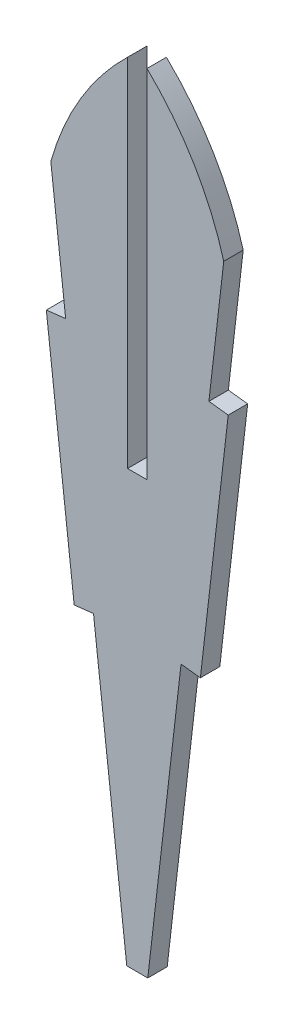
ISO-10303-21;
HEADER;
FILE_DESCRIPTION(('STEP AP214'),'2;1');
FILE_NAME('part.step','',(''),(''),'','','');
FILE_SCHEMA(('AUTOMOTIVE_DESIGN { 1 0 10303 214 1 1 1 1 }'));
ENDSEC;
DATA;
#1=APPLICATION_CONTEXT('core data for automotive mechanical design processes');
#2=APPLICATION_PROTOCOL_DEFINITION('international standard','automotive_design',2000,#1);
#3=PRODUCT_CONTEXT('',#1,'mechanical');
#4=PRODUCT('Part','Part','',(#3));
#5=PRODUCT_RELATED_PRODUCT_CATEGORY('part','',(#4));
#6=PRODUCT_DEFINITION_FORMATION('','',#4);
#7=PRODUCT_DEFINITION_CONTEXT('part definition',#1,'design');
#8=PRODUCT_DEFINITION('design','',#6,#7);
#9=PRODUCT_DEFINITION_SHAPE('','',#8);
#10=(LENGTH_UNIT() NAMED_UNIT(*) SI_UNIT(.MILLI.,.METRE.));
#11=(NAMED_UNIT(*) PLANE_ANGLE_UNIT() SI_UNIT($,.RADIAN.));
#12=(NAMED_UNIT(*) SI_UNIT($,.STERADIAN.) SOLID_ANGLE_UNIT());
#13=UNCERTAINTY_MEASURE_WITH_UNIT(LENGTH_MEASURE(1.E-05),#10,'distance_accuracy_value','');
#14=(GEOMETRIC_REPRESENTATION_CONTEXT(3) GLOBAL_UNCERTAINTY_ASSIGNED_CONTEXT((#13)) GLOBAL_UNIT_ASSIGNED_CONTEXT((#10,
#11,#12)) REPRESENTATION_CONTEXT('',''));
#15=CARTESIAN_POINT('',(0.,0.,0.));
#16=DIRECTION('',(0.,0.,1.));
#17=DIRECTION('',(1.,0.,0.));
#18=AXIS2_PLACEMENT_3D('',#15,#16,#17);
#19=CARTESIAN_POINT('',(-1.58511702127161,-218.846004156376,1.524));
#20=DIRECTION('',(0.,1.,0.));
#21=DIRECTION('',(0.,0.,1.));
#22=AXIS2_PLACEMENT_3D('',#19,#20,#21);
#23=PLANE('',#22);
#24=DIRECTION('',(1.,0.,0.));
#25=VECTOR('',#24,1.);
#26=CARTESIAN_POINT('',(-1.58511702127161,-218.846004156376,0.));
#27=LINE('',#26,#25);
#28=CARTESIAN_POINT('',(-1.58511702127161,-218.846004156376,0.));
#29=VERTEX_POINT('',#28);
#30=CARTESIAN_POINT('',(0.0611170212716098,-218.846004156376,0.));
#31=VERTEX_POINT('',#30);
#32=EDGE_CURVE('E185',#29,#31,#27,.T.);
#33=ORIENTED_EDGE('',*,*,#32,.T.);
#34=DIRECTION('',(0.,0.,-1.));
#35=VECTOR('',#34,1.);
#36=CARTESIAN_POINT('',(0.0611170212716098,-218.846004156376,1.524));
#37=LINE('',#36,#35);
#38=CARTESIAN_POINT('',(0.0611170212716098,-218.846004156376,1.524));
#39=VERTEX_POINT('',#38);
#40=EDGE_CURVE('E11',#39,#31,#37,.T.);
#41=ORIENTED_EDGE('',*,*,#40,.F.);
#42=DIRECTION('',(1.,0.,0.));
#43=VECTOR('',#42,1.);
#44=CARTESIAN_POINT('',(-1.58511702127161,-218.846004156376,1.524));
#45=LINE('',#44,#43);
#46=CARTESIAN_POINT('',(-1.58511702127161,-218.846004156376,1.524));
#47=VERTEX_POINT('',#46);
#48=EDGE_CURVE('E215',#47,#39,#45,.T.);
#49=ORIENTED_EDGE('',*,*,#48,.F.);
#50=DIRECTION('',(0.,0.,-1.));
#51=VECTOR('',#50,1.);
#52=CARTESIAN_POINT('',(-1.58511702127161,-218.846004156376,1.524));
#53=LINE('',#52,#51);
#54=EDGE_CURVE('E181',#47,#29,#53,.T.);
#55=ORIENTED_EDGE('',*,*,#54,.T.);
#56=EDGE_LOOP('',(#33,#41,#49,#55));
#57=FACE_BOUND('',#56,.T.);
#58=ADVANCED_FACE('F41',(#57),#23,.F.);
#59=CARTESIAN_POINT('',(2.66814649701083,-196.241399758573,1.524));
#60=DIRECTION('',(-0.993414910122723,0.114572319282901,0.));
#61=DIRECTION('',(-0.114572319282901,-0.993414910122723,0.));
#62=AXIS2_PLACEMENT_3D('',#59,#60,#61);
#63=PLANE('',#62);
#64=DIRECTION('',(0.114572319282901,0.993414910122723,0.));
#65=VECTOR('',#64,1.);
#66=CARTESIAN_POINT('',(2.66814649701083,-196.241399758573,0.));
#67=LINE('',#66,#65);
#68=CARTESIAN_POINT('',(2.66814649701083,-196.241399758573,0.));
#69=VERTEX_POINT('',#68);
#70=EDGE_CURVE('E188',#31,#69,#67,.T.);
#71=ORIENTED_EDGE('',*,*,#70,.T.);
#72=DIRECTION('',(0.,0.,-1.));
#73=VECTOR('',#72,1.);
#74=CARTESIAN_POINT('',(2.66814649701083,-196.241399758573,1.524));
#75=LINE('',#74,#73);
#76=CARTESIAN_POINT('',(2.66814649701083,-196.241399758573,1.524));
#77=VERTEX_POINT('',#76);
#78=EDGE_CURVE('E49',#77,#69,#75,.T.);
#79=ORIENTED_EDGE('',*,*,#78,.F.);
#80=DIRECTION('',(0.114572319282901,0.993414910122723,0.));
#81=VECTOR('',#80,1.);
#82=CARTESIAN_POINT('',(2.66814649701083,-196.241399758573,1.524));
#83=LINE('',#82,#81);
#84=EDGE_CURVE('E124',#39,#77,#83,.T.);
#85=ORIENTED_EDGE('',*,*,#84,.F.);
#86=ORIENTED_EDGE('',*,*,#40,.T.);
#87=EDGE_LOOP('',(#71,#79,#85,#86));
#88=FACE_BOUND('',#87,.T.);
#89=ADVANCED_FACE('F313',(#88),#63,.F.);
#90=CARTESIAN_POINT('',(2.66814649701083,-196.241399758573,1.524));
#91=DIRECTION('',(0.114572319282904,0.993414910122722,0.));
#92=DIRECTION('',(-0.993414910122722,0.114572319282904,0.));
#93=AXIS2_PLACEMENT_3D('',#90,#91,#92);
#94=PLANE('',#93);
#95=DIRECTION('',(0.993414910122722,-0.114572319282904,0.));
#96=VECTOR('',#95,1.);
#97=CARTESIAN_POINT('',(2.66814649701083,-196.241399758573,0.));
#98=LINE('',#97,#96);
#99=CARTESIAN_POINT('',(4.18211082003786,-196.41600797316,0.));
#100=VERTEX_POINT('',#99);
#101=EDGE_CURVE('E190',#69,#100,#98,.T.);
#102=ORIENTED_EDGE('',*,*,#101,.T.);
#103=DIRECTION('',(0.,0.,-1.));
#104=VECTOR('',#103,1.);
#105=CARTESIAN_POINT('',(4.18211082003786,-196.41600797316,1.524));
#106=LINE('',#105,#104);
#107=CARTESIAN_POINT('',(4.18211082003786,-196.41600797316,1.524));
#108=VERTEX_POINT('',#107);
#109=EDGE_CURVE('E246',#108,#100,#106,.T.);
#110=ORIENTED_EDGE('',*,*,#109,.F.);
#111=DIRECTION('',(0.993414910122722,-0.114572319282904,0.));
#112=VECTOR('',#111,1.);
#113=CARTESIAN_POINT('',(2.66814649701083,-196.241399758573,1.524));
#114=LINE('',#113,#112);
#115=EDGE_CURVE('E254',#77,#108,#114,.T.);
#116=ORIENTED_EDGE('',*,*,#115,.F.);
#117=ORIENTED_EDGE('',*,*,#78,.T.);
#118=EDGE_LOOP('',(#102,#110,#116,#117));
#119=FACE_BOUND('',#118,.T.);
#120=ADVANCED_FACE('F252',(#119),#94,.F.);
#121=CARTESIAN_POINT('',(6.36471350237713,-177.491453935322,1.524));
#122=DIRECTION('',(-0.993414910122722,0.114572319282902,0.));
#123=DIRECTION('',(-0.114572319282902,-0.993414910122723,0.));
#124=AXIS2_PLACEMENT_3D('',#121,#122,#123);
#125=PLANE('',#124);
#126=DIRECTION('',(0.114572319282902,0.993414910122722,0.));
#127=VECTOR('',#126,1.);
#128=CARTESIAN_POINT('',(6.36471350237713,-177.491453935322,0.));
#129=LINE('',#128,#127);
#130=CARTESIAN_POINT('',(6.36471350237713,-177.491453935322,0.));
#131=VERTEX_POINT('',#130);
#132=EDGE_CURVE('E192',#100,#131,#129,.T.);
#133=ORIENTED_EDGE('',*,*,#132,.T.);
#134=DIRECTION('',(0.,0.,-1.));
#135=VECTOR('',#134,1.);
#136=CARTESIAN_POINT('',(6.36471350237713,-177.491453935322,1.524));
#137=LINE('',#136,#135);
#138=CARTESIAN_POINT('',(6.36471350237713,-177.491453935322,1.524));
#139=VERTEX_POINT('',#138);
#140=EDGE_CURVE('E243',#139,#131,#137,.T.);
#141=ORIENTED_EDGE('',*,*,#140,.F.);
#142=DIRECTION('',(0.114572319282902,0.993414910122722,0.));
#143=VECTOR('',#142,1.);
#144=CARTESIAN_POINT('',(6.36471350237713,-177.491453935322,1.524));
#145=LINE('',#144,#143);
#146=EDGE_CURVE('E272',#108,#139,#145,.T.);
#147=ORIENTED_EDGE('',*,*,#146,.F.);
#148=ORIENTED_EDGE('',*,*,#109,.T.);
#149=EDGE_LOOP('',(#133,#141,#147,#148));
#150=FACE_BOUND('',#149,.T.);
#151=ADVANCED_FACE('F263',(#150),#125,.F.);
#152=CARTESIAN_POINT('',(4.8507491793501,-177.316845720735,1.524));
#153=DIRECTION('',(-0.114572319282922,-0.99341491012272,0.));
#154=DIRECTION('',(0.99341491012272,-0.114572319282922,0.));
#155=AXIS2_PLACEMENT_3D('',#152,#153,#154);
#156=PLANE('',#155);
#157=DIRECTION('',(-0.99341491012272,0.114572319282922,0.));
#158=VECTOR('',#157,1.);
#159=CARTESIAN_POINT('',(4.8507491793501,-177.316845720735,0.));
#160=LINE('',#159,#158);
#161=CARTESIAN_POINT('',(4.8507491793501,-177.316845720735,0.));
#162=VERTEX_POINT('',#161);
#163=EDGE_CURVE('E194',#131,#162,#160,.T.);
#164=ORIENTED_EDGE('',*,*,#163,.T.);
#165=DIRECTION('',(0.,0.,-1.));
#166=VECTOR('',#165,1.);
#167=CARTESIAN_POINT('',(4.8507491793501,-177.316845720735,1.524));
#168=LINE('',#167,#166);
#169=CARTESIAN_POINT('',(4.8507491793501,-177.316845720735,1.524));
#170=VERTEX_POINT('',#169);
#171=EDGE_CURVE('E240',#170,#162,#168,.T.);
#172=ORIENTED_EDGE('',*,*,#171,.F.);
#173=DIRECTION('',(-0.99341491012272,0.114572319282922,0.));
#174=VECTOR('',#173,1.);
#175=CARTESIAN_POINT('',(4.8507491793501,-177.316845720735,1.524));
#176=LINE('',#175,#174);
#177=EDGE_CURVE('E269',#139,#170,#176,.T.);
#178=ORIENTED_EDGE('',*,*,#177,.F.);
#179=ORIENTED_EDGE('',*,*,#140,.T.);
#180=EDGE_LOOP('',(#164,#172,#178,#179));
#181=FACE_BOUND('',#180,.T.);
#182=ADVANCED_FACE('F267',(#181),#156,.F.);
#183=CARTESIAN_POINT('',(6.01355397832156,-167.23458822529,1.524));
#184=DIRECTION('',(-0.993414910122723,0.114572319282901,0.));
#185=DIRECTION('',(-0.114572319282901,-0.993414910122723,0.));
#186=AXIS2_PLACEMENT_3D('',#183,#184,#185);
#187=PLANE('',#186);
#188=DIRECTION('',(0.114572319282901,0.993414910122723,0.));
#189=VECTOR('',#188,1.);
#190=CARTESIAN_POINT('',(6.01355397832156,-167.23458822529,0.));
#191=LINE('',#190,#189);
#192=CARTESIAN_POINT('',(6.01355397832155,-167.23458822529,0.));
#193=VERTEX_POINT('',#192);
#194=EDGE_CURVE('E196',#162,#193,#191,.T.);
#195=ORIENTED_EDGE('',*,*,#194,.T.);
#196=DIRECTION('',(0.,0.,-1.));
#197=VECTOR('',#196,1.);
#198=CARTESIAN_POINT('',(6.01355397832155,-167.23458822529,1.524));
#199=LINE('',#198,#197);
#200=CARTESIAN_POINT('',(6.01355397832155,-167.23458822529,1.524));
#201=VERTEX_POINT('',#200);
#202=EDGE_CURVE('E237',#201,#193,#199,.T.);
#203=ORIENTED_EDGE('',*,*,#202,.F.);
#204=DIRECTION('',(0.114572319282901,0.993414910122723,0.));
#205=VECTOR('',#204,1.);
#206=CARTESIAN_POINT('',(6.01355397832156,-167.23458822529,1.524));
#207=LINE('',#206,#205);
#208=EDGE_CURVE('E271',#170,#201,#207,.T.);
#209=ORIENTED_EDGE('',*,*,#208,.F.);
#210=ORIENTED_EDGE('',*,*,#171,.T.);
#211=EDGE_LOOP('',(#195,#203,#209,#210));
#212=FACE_BOUND('',#211,.T.);
#213=ADVANCED_FACE('F326',(#212),#187,.F.);
#214=CARTESIAN_POINT('',(-15.559815132406,-173.267487686723,1.524));
#215=DIRECTION('',(0.,0.,-1.));
#216=DIRECTION('',(-1.,0.,0.));
#217=AXIS2_PLACEMENT_3D('',#214,#215,#216);
#218=CYLINDRICAL_SURFACE('',#217,22.4010296794468);
#219=CARTESIAN_POINT('',(-15.559815132406,-173.267487686723,0.));
#220=DIRECTION('',(0.,0.,1.));
#221=DIRECTION('',(1.,0.,0.));
#222=AXIS2_PLACEMENT_3D('',#219,#220,#221);
#223=CIRCLE('',#222,22.4010296794468);
#224=CARTESIAN_POINT('',(0.,-157.152330729846,0.));
#225=VERTEX_POINT('',#224);
#226=EDGE_CURVE('E198',#193,#225,#223,.T.);
#227=ORIENTED_EDGE('',*,*,#226,.T.);
#228=DIRECTION('',(0.,0.,-1.));
#229=VECTOR('',#228,1.);
#230=CARTESIAN_POINT('',(0.,-157.152330729846,1.524));
#231=LINE('',#230,#229);
#232=CARTESIAN_POINT('',(0.,-157.152330729846,1.524));
#233=VERTEX_POINT('',#232);
#234=EDGE_CURVE('E234',#233,#225,#231,.T.);
#235=ORIENTED_EDGE('',*,*,#234,.F.);
#236=CARTESIAN_POINT('',(-15.559815132406,-173.267487686723,1.524));
#237=DIRECTION('',(0.,0.,1.));
#238=DIRECTION('',(1.,0.,0.));
#239=AXIS2_PLACEMENT_3D('',#236,#237,#238);
#240=CIRCLE('',#239,22.4010296794468);
#241=EDGE_CURVE('E274',#201,#233,#240,.T.);
#242=ORIENTED_EDGE('',*,*,#241,.F.);
#243=ORIENTED_EDGE('',*,*,#202,.T.);
#244=EDGE_LOOP('',(#227,#235,#242,#243));
#245=FACE_BOUND('',#244,.T.);
#246=ADVANCED_FACE('F329',(#245),#218,.T.);
#247=CARTESIAN_POINT('',(0.,-185.062075143658,1.524));
#248=DIRECTION('',(1.,0.,0.));
#249=DIRECTION('',(0.,1.,0.));
#250=AXIS2_PLACEMENT_3D('',#247,#248,#249);
#251=PLANE('',#250);
#252=DIRECTION('',(0.,-1.,0.));
#253=VECTOR('',#252,1.);
#254=CARTESIAN_POINT('',(0.,-185.062075143658,0.));
#255=LINE('',#254,#253);
#256=CARTESIAN_POINT('',(0.,-185.062075143658,0.));
#257=VERTEX_POINT('',#256);
#258=EDGE_CURVE('E200',#225,#257,#255,.T.);
#259=ORIENTED_EDGE('',*,*,#258,.T.);
#260=DIRECTION('',(0.,0.,-1.));
#261=VECTOR('',#260,1.);
#262=CARTESIAN_POINT('',(0.,-185.062075143658,1.524));
#263=LINE('',#262,#261);
#264=CARTESIAN_POINT('',(0.,-185.062075143658,1.524));
#265=VERTEX_POINT('',#264);
#266=EDGE_CURVE('E231',#265,#257,#263,.T.);
#267=ORIENTED_EDGE('',*,*,#266,.F.);
#268=DIRECTION('',(0.,-1.,0.));
#269=VECTOR('',#268,1.);
#270=CARTESIAN_POINT('',(0.,-185.062075143658,1.524));
#271=LINE('',#270,#269);
#272=EDGE_CURVE('E280',#233,#265,#271,.T.);
#273=ORIENTED_EDGE('',*,*,#272,.F.);
#274=ORIENTED_EDGE('',*,*,#234,.T.);
#275=EDGE_LOOP('',(#259,#267,#273,#274));
#276=FACE_BOUND('',#275,.T.);
#277=ADVANCED_FACE('F333',(#276),#251,.F.);
#278=CARTESIAN_POINT('',(0.,-185.062075143658,1.524));
#279=DIRECTION('',(0.,-1.,0.));
#280=DIRECTION('',(0.,0.,-1.));
#281=AXIS2_PLACEMENT_3D('',#278,#279,#280);
#282=PLANE('',#281);
#283=DIRECTION('',(-1.,0.,0.));
#284=VECTOR('',#283,1.);
#285=CARTESIAN_POINT('',(0.,-185.062075143658,0.));
#286=LINE('',#285,#284);
#287=CARTESIAN_POINT('',(-1.524,-185.062075143658,0.));
#288=VERTEX_POINT('',#287);
#289=EDGE_CURVE('E202',#257,#288,#286,.T.);
#290=ORIENTED_EDGE('',*,*,#289,.T.);
#291=DIRECTION('',(0.,0.,-1.));
#292=VECTOR('',#291,1.);
#293=CARTESIAN_POINT('',(-1.524,-185.062075143658,1.524));
#294=LINE('',#293,#292);
#295=CARTESIAN_POINT('',(-1.524,-185.062075143658,1.524));
#296=VERTEX_POINT('',#295);
#297=EDGE_CURVE('E228',#296,#288,#294,.T.);
#298=ORIENTED_EDGE('',*,*,#297,.F.);
#299=DIRECTION('',(-1.,0.,0.));
#300=VECTOR('',#299,1.);
#301=CARTESIAN_POINT('',(0.,-185.062075143658,1.524));
#302=LINE('',#301,#300);
#303=EDGE_CURVE('E282',#265,#296,#302,.T.);
#304=ORIENTED_EDGE('',*,*,#303,.F.);
#305=ORIENTED_EDGE('',*,*,#266,.T.);
#306=EDGE_LOOP('',(#290,#298,#304,#305));
#307=FACE_BOUND('',#306,.T.);
#308=ADVANCED_FACE('F337',(#307),#282,.F.);
#309=CARTESIAN_POINT('',(-1.524,-185.062075143658,1.524));
#310=DIRECTION('',(-1.,0.,0.));
#311=DIRECTION('',(0.,-1.,0.));
#312=AXIS2_PLACEMENT_3D('',#309,#310,#311);
#313=PLANE('',#312);
#314=DIRECTION('',(0.,1.,0.));
#315=VECTOR('',#314,1.);
#316=CARTESIAN_POINT('',(-1.524,-185.062075143658,0.));
#317=LINE('',#316,#315);
#318=CARTESIAN_POINT('',(-1.52400000000001,-157.152330729846,0.));
#319=VERTEX_POINT('',#318);
#320=EDGE_CURVE('E204',#288,#319,#317,.T.);
#321=ORIENTED_EDGE('',*,*,#320,.T.);
#322=DIRECTION('',(0.,0.,-1.));
#323=VECTOR('',#322,1.);
#324=CARTESIAN_POINT('',(-1.52400000000001,-157.152330729846,1.524));
#325=LINE('',#324,#323);
#326=CARTESIAN_POINT('',(-1.52400000000001,-157.152330729846,1.524));
#327=VERTEX_POINT('',#326);
#328=EDGE_CURVE('E225',#327,#319,#325,.T.);
#329=ORIENTED_EDGE('',*,*,#328,.F.);
#330=DIRECTION('',(0.,1.,0.));
#331=VECTOR('',#330,1.);
#332=CARTESIAN_POINT('',(-1.524,-185.062075143658,1.524));
#333=LINE('',#332,#331);
#334=EDGE_CURVE('E284',#296,#327,#333,.T.);
#335=ORIENTED_EDGE('',*,*,#334,.F.);
#336=ORIENTED_EDGE('',*,*,#297,.T.);
#337=EDGE_LOOP('',(#321,#329,#335,#336));
#338=FACE_BOUND('',#337,.T.);
#339=ADVANCED_FACE('F341',(#338),#313,.F.);
#340=CARTESIAN_POINT('',(14.035815132406,-173.267487686723,1.524));
#341=DIRECTION('',(0.,0.,-1.));
#342=DIRECTION('',(-1.,0.,0.));
#343=AXIS2_PLACEMENT_3D('',#340,#341,#342);
#344=CYLINDRICAL_SURFACE('',#343,22.4010296794468);
#345=CARTESIAN_POINT('',(14.035815132406,-173.267487686723,0.));
#346=DIRECTION('',(0.,0.,1.));
#347=DIRECTION('',(-1.,0.,0.));
#348=AXIS2_PLACEMENT_3D('',#345,#346,#347);
#349=CIRCLE('',#348,22.4010296794468);
#350=CARTESIAN_POINT('',(-7.53755397832156,-167.23458822529,0.));
#351=VERTEX_POINT('',#350);
#352=EDGE_CURVE('E206',#319,#351,#349,.T.);
#353=ORIENTED_EDGE('',*,*,#352,.T.);
#354=DIRECTION('',(0.,0.,-1.));
#355=VECTOR('',#354,1.);
#356=CARTESIAN_POINT('',(-7.53755397832156,-167.23458822529,1.524));
#357=LINE('',#356,#355);
#358=CARTESIAN_POINT('',(-7.53755397832156,-167.23458822529,1.524));
#359=VERTEX_POINT('',#358);
#360=EDGE_CURVE('E222',#359,#351,#357,.T.);
#361=ORIENTED_EDGE('',*,*,#360,.F.);
#362=CARTESIAN_POINT('',(14.035815132406,-173.267487686723,1.524));
#363=DIRECTION('',(0.,0.,1.));
#364=DIRECTION('',(-1.,0.,0.));
#365=AXIS2_PLACEMENT_3D('',#362,#363,#364);
#366=CIRCLE('',#365,22.4010296794468);
#367=EDGE_CURVE('E286',#327,#359,#366,.T.);
#368=ORIENTED_EDGE('',*,*,#367,.F.);
#369=ORIENTED_EDGE('',*,*,#328,.T.);
#370=EDGE_LOOP('',(#353,#361,#368,#369));
#371=FACE_BOUND('',#370,.T.);
#372=ADVANCED_FACE('F345',(#371),#344,.T.);
#373=CARTESIAN_POINT('',(-7.53755397832156,-167.23458822529,1.524));
#374=DIRECTION('',(0.993414910122723,0.114572319282901,0.));
#375=DIRECTION('',(-0.114572319282901,0.993414910122723,0.));
#376=AXIS2_PLACEMENT_3D('',#373,#374,#375);
#377=PLANE('',#376);
#378=DIRECTION('',(0.114572319282901,-0.993414910122723,0.));
#379=VECTOR('',#378,1.);
#380=CARTESIAN_POINT('',(-7.53755397832156,-167.23458822529,0.));
#381=LINE('',#380,#379);
#382=CARTESIAN_POINT('',(-6.3747491793501,-177.316845720735,0.));
#383=VERTEX_POINT('',#382);
#384=EDGE_CURVE('E208',#351,#383,#381,.T.);
#385=ORIENTED_EDGE('',*,*,#384,.T.);
#386=DIRECTION('',(0.,0.,-1.));
#387=VECTOR('',#386,1.);
#388=CARTESIAN_POINT('',(-6.3747491793501,-177.316845720735,1.524));
#389=LINE('',#388,#387);
#390=CARTESIAN_POINT('',(-6.3747491793501,-177.316845720735,1.524));
#391=VERTEX_POINT('',#390);
#392=EDGE_CURVE('E219',#391,#383,#389,.T.);
#393=ORIENTED_EDGE('',*,*,#392,.F.);
#394=DIRECTION('',(0.114572319282901,-0.993414910122723,0.));
#395=VECTOR('',#394,1.);
#396=CARTESIAN_POINT('',(-7.53755397832156,-167.23458822529,1.524));
#397=LINE('',#396,#395);
#398=EDGE_CURVE('E288',#359,#391,#397,.T.);
#399=ORIENTED_EDGE('',*,*,#398,.F.);
#400=ORIENTED_EDGE('',*,*,#360,.T.);
#401=EDGE_LOOP('',(#385,#393,#399,#400));
#402=FACE_BOUND('',#401,.T.);
#403=ADVANCED_FACE('F294',(#402),#377,.F.);
#404=CARTESIAN_POINT('',(-6.3747491793501,-177.316845720735,1.524));
#405=DIRECTION('',(0.114572319282922,-0.99341491012272,0.));
#406=DIRECTION('',(0.99341491012272,0.114572319282922,0.));
#407=AXIS2_PLACEMENT_3D('',#404,#405,#406);
#408=PLANE('',#407);
#409=DIRECTION('',(-0.99341491012272,-0.114572319282922,0.));
#410=VECTOR('',#409,1.);
#411=CARTESIAN_POINT('',(-6.3747491793501,-177.316845720735,0.));
#412=LINE('',#411,#410);
#413=CARTESIAN_POINT('',(-7.88871350237714,-177.491453935322,0.));
#414=VERTEX_POINT('',#413);
#415=EDGE_CURVE('E210',#383,#414,#412,.T.);
#416=ORIENTED_EDGE('',*,*,#415,.T.);
#417=DIRECTION('',(0.,0.,-1.));
#418=VECTOR('',#417,1.);
#419=CARTESIAN_POINT('',(-7.88871350237714,-177.491453935322,1.524));
#420=LINE('',#419,#418);
#421=CARTESIAN_POINT('',(-7.88871350237714,-177.491453935322,1.524));
#422=VERTEX_POINT('',#421);
#423=EDGE_CURVE('E176',#422,#414,#420,.T.);
#424=ORIENTED_EDGE('',*,*,#423,.F.);
#425=DIRECTION('',(-0.99341491012272,-0.114572319282922,0.));
#426=VECTOR('',#425,1.);
#427=CARTESIAN_POINT('',(-6.3747491793501,-177.316845720735,1.524));
#428=LINE('',#427,#426);
#429=EDGE_CURVE('E167',#391,#422,#428,.T.);
#430=ORIENTED_EDGE('',*,*,#429,.F.);
#431=ORIENTED_EDGE('',*,*,#392,.T.);
#432=EDGE_LOOP('',(#416,#424,#430,#431));
#433=FACE_BOUND('',#432,.T.);
#434=ADVANCED_FACE('F298',(#433),#408,.F.);
#435=CARTESIAN_POINT('',(-7.88871350237714,-177.491453935322,1.524));
#436=DIRECTION('',(0.993414910122722,0.114572319282902,0.));
#437=DIRECTION('',(-0.114572319282902,0.993414910122723,0.));
#438=AXIS2_PLACEMENT_3D('',#435,#436,#437);
#439=PLANE('',#438);
#440=DIRECTION('',(0.114572319282902,-0.993414910122722,0.));
#441=VECTOR('',#440,1.);
#442=CARTESIAN_POINT('',(-7.88871350237714,-177.491453935322,0.));
#443=LINE('',#442,#441);
#444=CARTESIAN_POINT('',(-5.70611082003786,-196.41600797316,0.));
#445=VERTEX_POINT('',#444);
#446=EDGE_CURVE('E175',#414,#445,#443,.T.);
#447=ORIENTED_EDGE('',*,*,#446,.T.);
#448=DIRECTION('',(0.,0.,-1.));
#449=VECTOR('',#448,1.);
#450=CARTESIAN_POINT('',(-5.70611082003786,-196.41600797316,1.524));
#451=LINE('',#450,#449);
#452=CARTESIAN_POINT('',(-5.70611082003786,-196.41600797316,1.524));
#453=VERTEX_POINT('',#452);
#454=EDGE_CURVE('E172',#453,#445,#451,.T.);
#455=ORIENTED_EDGE('',*,*,#454,.F.);
#456=DIRECTION('',(0.114572319282902,-0.993414910122722,0.));
#457=VECTOR('',#456,1.);
#458=CARTESIAN_POINT('',(-7.88871350237714,-177.491453935322,1.524));
#459=LINE('',#458,#457);
#460=EDGE_CURVE('E161',#422,#453,#459,.T.);
#461=ORIENTED_EDGE('',*,*,#460,.F.);
#462=ORIENTED_EDGE('',*,*,#423,.T.);
#463=EDGE_LOOP('',(#447,#455,#461,#462));
#464=FACE_BOUND('',#463,.T.);
#465=ADVANCED_FACE('F173',(#464),#439,.F.);
#466=CARTESIAN_POINT('',(-4.19214649701083,-196.241399758573,1.524));
#467=DIRECTION('',(-0.114572319282904,0.993414910122722,0.));
#468=DIRECTION('',(-0.993414910122722,-0.114572319282904,0.));
#469=AXIS2_PLACEMENT_3D('',#466,#467,#468);
#470=PLANE('',#469);
#471=DIRECTION('',(0.993414910122722,0.114572319282904,0.));
#472=VECTOR('',#471,1.);
#473=CARTESIAN_POINT('',(-4.19214649701083,-196.241399758573,0.));
#474=LINE('',#473,#472);
#475=CARTESIAN_POINT('',(-4.19214649701083,-196.241399758573,0.));
#476=VERTEX_POINT('',#475);
#477=EDGE_CURVE('E110',#445,#476,#474,.T.);
#478=ORIENTED_EDGE('',*,*,#477,.T.);
#479=DIRECTION('',(0.,0.,-1.));
#480=VECTOR('',#479,1.);
#481=CARTESIAN_POINT('',(-4.19214649701083,-196.241399758573,1.524));
#482=LINE('',#481,#480);
#483=CARTESIAN_POINT('',(-4.19214649701083,-196.241399758573,1.524));
#484=VERTEX_POINT('',#483);
#485=EDGE_CURVE('E177',#484,#476,#482,.T.);
#486=ORIENTED_EDGE('',*,*,#485,.F.);
#487=DIRECTION('',(0.993414910122722,0.114572319282904,0.));
#488=VECTOR('',#487,1.);
#489=CARTESIAN_POINT('',(-4.19214649701083,-196.241399758573,1.524));
#490=LINE('',#489,#488);
#491=EDGE_CURVE('E165',#453,#484,#490,.T.);
#492=ORIENTED_EDGE('',*,*,#491,.F.);
#493=ORIENTED_EDGE('',*,*,#454,.T.);
#494=EDGE_LOOP('',(#478,#486,#492,#493));
#495=FACE_BOUND('',#494,.T.);
#496=ADVANCED_FACE('F179',(#495),#470,.F.);
#497=CARTESIAN_POINT('',(-4.19214649701083,-196.241399758573,1.524));
#498=DIRECTION('',(0.993414910122723,0.114572319282901,0.));
#499=DIRECTION('',(-0.114572319282901,0.993414910122723,0.));
#500=AXIS2_PLACEMENT_3D('',#497,#498,#499);
#501=PLANE('',#500);
#502=DIRECTION('',(0.114572319282901,-0.993414910122723,0.));
#503=VECTOR('',#502,1.);
#504=CARTESIAN_POINT('',(-4.19214649701083,-196.241399758573,0.));
#505=LINE('',#504,#503);
#506=EDGE_CURVE('E116',#476,#29,#505,.T.);
#507=ORIENTED_EDGE('',*,*,#506,.T.);
#508=ORIENTED_EDGE('',*,*,#54,.F.);
#509=DIRECTION('',(0.114572319282901,-0.993414910122723,0.));
#510=VECTOR('',#509,1.);
#511=CARTESIAN_POINT('',(-4.19214649701083,-196.241399758573,1.524));
#512=LINE('',#511,#510);
#513=EDGE_CURVE('E57',#484,#47,#512,.T.);
#514=ORIENTED_EDGE('',*,*,#513,.F.);
#515=ORIENTED_EDGE('',*,*,#485,.T.);
#516=EDGE_LOOP('',(#507,#508,#514,#515));
#517=FACE_BOUND('',#516,.T.);
#518=ADVANCED_FACE('F302',(#517),#501,.F.);
#519=CARTESIAN_POINT('',(-15.559815132406,-173.267487686723,1.524));
#520=DIRECTION('',(0.,0.,1.));
#521=DIRECTION('',(1.,0.,0.));
#522=AXIS2_PLACEMENT_3D('',#519,#520,#521);
#523=PLANE('',#522);
#524=ORIENTED_EDGE('',*,*,#48,.T.);
#525=ORIENTED_EDGE('',*,*,#84,.T.);
#526=ORIENTED_EDGE('',*,*,#115,.T.);
#527=ORIENTED_EDGE('',*,*,#146,.T.);
#528=ORIENTED_EDGE('',*,*,#177,.T.);
#529=ORIENTED_EDGE('',*,*,#208,.T.);
#530=ORIENTED_EDGE('',*,*,#241,.T.);
#531=ORIENTED_EDGE('',*,*,#272,.T.);
#532=ORIENTED_EDGE('',*,*,#303,.T.);
#533=ORIENTED_EDGE('',*,*,#334,.T.);
#534=ORIENTED_EDGE('',*,*,#367,.T.);
#535=ORIENTED_EDGE('',*,*,#398,.T.);
#536=ORIENTED_EDGE('',*,*,#429,.T.);
#537=ORIENTED_EDGE('',*,*,#460,.T.);
#538=ORIENTED_EDGE('',*,*,#491,.T.);
#539=ORIENTED_EDGE('',*,*,#513,.T.);
#540=EDGE_LOOP('',(#524,#525,#526,#527,#528,#529,#530,#531,#532,#533,#534,#535,#536,#537,#538,#539));
#541=FACE_BOUND('',#540,.T.);
#542=ADVANCED_FACE('F163',(#541),#523,.T.);
#543=CARTESIAN_POINT('',(-15.559815132406,-173.267487686723,0.));
#544=DIRECTION('',(0.,0.,1.));
#545=DIRECTION('',(1.,0.,0.));
#546=AXIS2_PLACEMENT_3D('',#543,#544,#545);
#547=PLANE('',#546);
#548=ORIENTED_EDGE('',*,*,#32,.F.);
#549=ORIENTED_EDGE('',*,*,#506,.F.);
#550=ORIENTED_EDGE('',*,*,#477,.F.);
#551=ORIENTED_EDGE('',*,*,#446,.F.);
#552=ORIENTED_EDGE('',*,*,#415,.F.);
#553=ORIENTED_EDGE('',*,*,#384,.F.);
#554=ORIENTED_EDGE('',*,*,#352,.F.);
#555=ORIENTED_EDGE('',*,*,#320,.F.);
#556=ORIENTED_EDGE('',*,*,#289,.F.);
#557=ORIENTED_EDGE('',*,*,#258,.F.);
#558=ORIENTED_EDGE('',*,*,#226,.F.);
#559=ORIENTED_EDGE('',*,*,#194,.F.);
#560=ORIENTED_EDGE('',*,*,#163,.F.);
#561=ORIENTED_EDGE('',*,*,#132,.F.);
#562=ORIENTED_EDGE('',*,*,#101,.F.);
#563=ORIENTED_EDGE('',*,*,#70,.F.);
#564=EDGE_LOOP('',(#548,#549,#550,#551,#552,#553,#554,#555,#556,#557,#558,#559,#560,#561,#562,#563));
#565=FACE_BOUND('',#564,.T.);
#566=ADVANCED_FACE('F258',(#565),#547,.F.);
#567=CLOSED_SHELL('',(#58,#89,#120,#151,#182,#213,#246,#277,#308,#339,#372,#403,#434,#465,#496,
#518,#542,#566));
#568=MANIFOLD_SOLID_BREP('B2',#567);
#569=ADVANCED_BREP_SHAPE_REPRESENTATION('',(#18,#568),#14);
#570=SHAPE_DEFINITION_REPRESENTATION(#9,#569);
ENDSEC;
END-ISO-10303-21;
